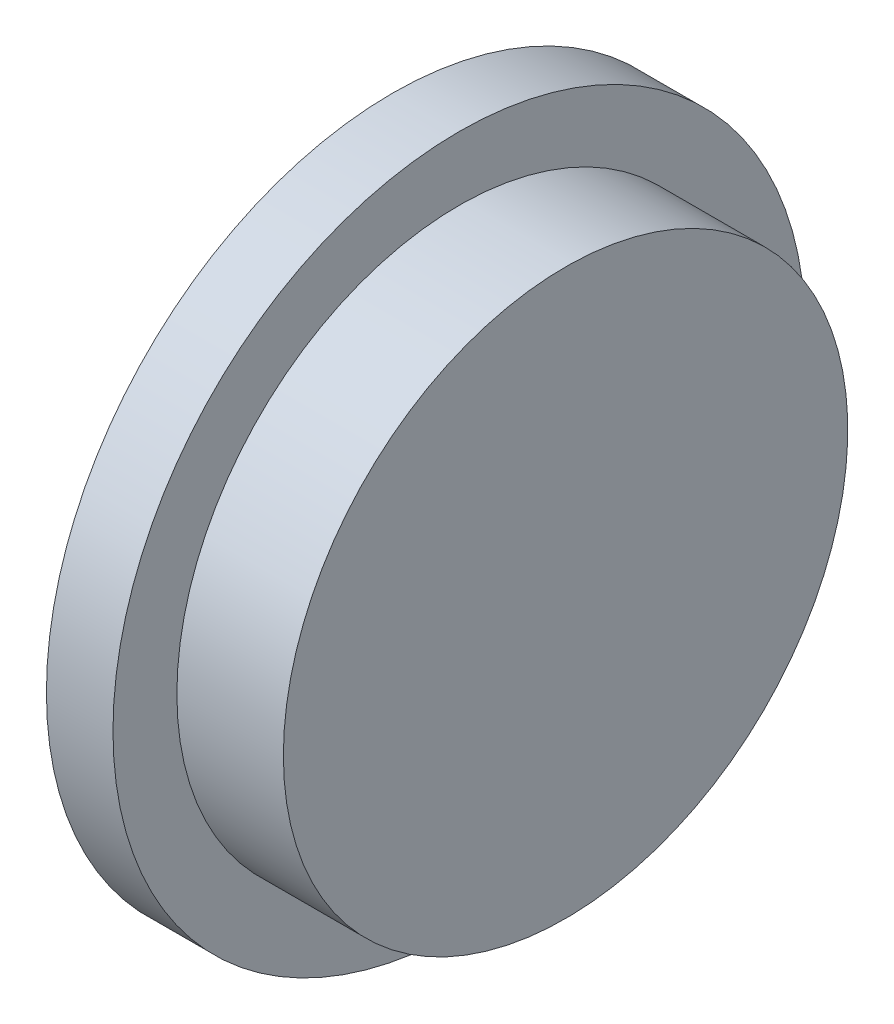
ISO-10303-21;
HEADER;
FILE_DESCRIPTION(('STEP AP214'),'2;1');
FILE_NAME('part.step','',(''),(''),'','','');
FILE_SCHEMA(('AUTOMOTIVE_DESIGN { 1 0 10303 214 1 1 1 1 }'));
ENDSEC;
DATA;
#1=APPLICATION_CONTEXT('core data for automotive mechanical design processes');
#2=APPLICATION_PROTOCOL_DEFINITION('international standard','automotive_design',2000,#1);
#3=PRODUCT_CONTEXT('',#1,'mechanical');
#4=PRODUCT('Part','Part','',(#3));
#5=PRODUCT_RELATED_PRODUCT_CATEGORY('part','',(#4));
#6=PRODUCT_DEFINITION_FORMATION('','',#4);
#7=PRODUCT_DEFINITION_CONTEXT('part definition',#1,'design');
#8=PRODUCT_DEFINITION('design','',#6,#7);
#9=PRODUCT_DEFINITION_SHAPE('','',#8);
#10=(LENGTH_UNIT() NAMED_UNIT(*) SI_UNIT(.MILLI.,.METRE.));
#11=(NAMED_UNIT(*) PLANE_ANGLE_UNIT() SI_UNIT($,.RADIAN.));
#12=(NAMED_UNIT(*) SI_UNIT($,.STERADIAN.) SOLID_ANGLE_UNIT());
#13=UNCERTAINTY_MEASURE_WITH_UNIT(LENGTH_MEASURE(1.E-05),#10,'distance_accuracy_value','');
#14=(GEOMETRIC_REPRESENTATION_CONTEXT(3) GLOBAL_UNCERTAINTY_ASSIGNED_CONTEXT((#13)) GLOBAL_UNIT_ASSIGNED_CONTEXT((#10,
#11,#12)) REPRESENTATION_CONTEXT('',''));
#15=CARTESIAN_POINT('',(0.,0.,0.));
#16=DIRECTION('',(0.,0.,1.));
#17=DIRECTION('',(1.,0.,0.));
#18=AXIS2_PLACEMENT_3D('',#15,#16,#17);
#19=CARTESIAN_POINT('',(0.,0.,0.));
#20=DIRECTION('',(1.,0.,0.));
#21=DIRECTION('',(0.,0.,-1.));
#22=AXIS2_PLACEMENT_3D('',#19,#20,#21);
#23=PLANE('',#22);
#24=CARTESIAN_POINT('',(0.,0.,0.));
#25=DIRECTION('',(-1.,0.,0.));
#26=DIRECTION('',(0.,0.,1.));
#27=AXIS2_PLACEMENT_3D('',#24,#25,#26);
#28=CIRCLE('',#27,2.8);
#29=CARTESIAN_POINT('',(0.,0.,2.8));
#30=VERTEX_POINT('',#29);
#31=EDGE_CURVE('E10',#30,#30,#28,.T.);
#32=ORIENTED_EDGE('',*,*,#31,.T.);
#33=EDGE_LOOP('',(#32));
#34=FACE_BOUND('',#33,.T.);
#35=ADVANCED_FACE('F33',(#34),#23,.F.);
#36=CARTESIAN_POINT('',(-1.67142857142857,0.,0.));
#37=DIRECTION('',(-1.,0.,0.));
#38=DIRECTION('',(0.,0.,1.));
#39=AXIS2_PLACEMENT_3D('',#36,#37,#38);
#40=CYLINDRICAL_SURFACE('',#39,2.8);
#41=ORIENTED_EDGE('',*,*,#31,.F.);
#42=EDGE_LOOP('',(#41));
#43=FACE_BOUND('',#42,.T.);
#44=CARTESIAN_POINT('',(2.,0.,0.));
#45=DIRECTION('',(-1.,0.,0.));
#46=DIRECTION('',(0.,0.,1.));
#47=AXIS2_PLACEMENT_3D('',#44,#45,#46);
#48=CIRCLE('',#47,2.8);
#49=CARTESIAN_POINT('',(2.,0.,2.8));
#50=VERTEX_POINT('',#49);
#51=EDGE_CURVE('E39',#50,#50,#48,.T.);
#52=ORIENTED_EDGE('',*,*,#51,.T.);
#53=EDGE_LOOP('',(#52));
#54=FACE_BOUND('',#53,.T.);
#55=ADVANCED_FACE('F71',(#43,#54),#40,.T.);
#56=CARTESIAN_POINT('',(2.,2.8,0.));
#57=DIRECTION('',(1.,0.,0.));
#58=DIRECTION('',(0.,0.,-1.));
#59=AXIS2_PLACEMENT_3D('',#56,#57,#58);
#60=PLANE('',#59);
#61=ORIENTED_EDGE('',*,*,#51,.F.);
#62=EDGE_LOOP('',(#61));
#63=FACE_BOUND('',#62,.T.);
#64=CARTESIAN_POINT('',(2.,0.,0.));
#65=DIRECTION('',(-1.,0.,0.));
#66=DIRECTION('',(0.,0.,1.));
#67=AXIS2_PLACEMENT_3D('',#64,#65,#66);
#68=CIRCLE('',#67,6.5);
#69=CARTESIAN_POINT('',(2.,0.,6.5));
#70=VERTEX_POINT('',#69);
#71=EDGE_CURVE('E43',#70,#70,#68,.T.);
#72=ORIENTED_EDGE('',*,*,#71,.T.);
#73=EDGE_LOOP('',(#72));
#74=FACE_BOUND('',#73,.T.);
#75=ADVANCED_FACE('F75',(#63,#74),#60,.F.);
#76=CARTESIAN_POINT('',(-1.67142857142857,0.,0.));
#77=DIRECTION('',(-1.,0.,0.));
#78=DIRECTION('',(0.,0.,1.));
#79=AXIS2_PLACEMENT_3D('',#76,#77,#78);
#80=CYLINDRICAL_SURFACE('',#79,6.5);
#81=ORIENTED_EDGE('',*,*,#71,.F.);
#82=EDGE_LOOP('',(#81));
#83=FACE_BOUND('',#82,.T.);
#84=CARTESIAN_POINT('',(3.25,0.,0.));
#85=DIRECTION('',(-1.,0.,0.));
#86=DIRECTION('',(0.,0.,1.));
#87=AXIS2_PLACEMENT_3D('',#84,#85,#86);
#88=CIRCLE('',#87,6.5);
#89=CARTESIAN_POINT('',(3.25,0.,6.5));
#90=VERTEX_POINT('',#89);
#91=EDGE_CURVE('E47',#90,#90,#88,.T.);
#92=ORIENTED_EDGE('',*,*,#91,.T.);
#93=EDGE_LOOP('',(#92));
#94=FACE_BOUND('',#93,.T.);
#95=ADVANCED_FACE('F80',(#83,#94),#80,.T.);
#96=CARTESIAN_POINT('',(3.25,6.5,0.));
#97=DIRECTION('',(-1.,0.,0.));
#98=DIRECTION('',(0.,0.,1.));
#99=AXIS2_PLACEMENT_3D('',#96,#97,#98);
#100=PLANE('',#99);
#101=ORIENTED_EDGE('',*,*,#91,.F.);
#102=EDGE_LOOP('',(#101));
#103=FACE_BOUND('',#102,.T.);
#104=CARTESIAN_POINT('',(3.25,0.,0.));
#105=DIRECTION('',(-1.,0.,0.));
#106=DIRECTION('',(0.,0.,1.));
#107=AXIS2_PLACEMENT_3D('',#104,#105,#106);
#108=CIRCLE('',#107,5.3);
#109=CARTESIAN_POINT('',(3.25,0.,5.3));
#110=VERTEX_POINT('',#109);
#111=EDGE_CURVE('E52',#110,#110,#108,.T.);
#112=ORIENTED_EDGE('',*,*,#111,.T.);
#113=EDGE_LOOP('',(#112));
#114=FACE_BOUND('',#113,.T.);
#115=ADVANCED_FACE('F67',(#103,#114),#100,.F.);
#116=CARTESIAN_POINT('',(-1.67142857142857,0.,0.));
#117=DIRECTION('',(-1.,0.,0.));
#118=DIRECTION('',(0.,0.,1.));
#119=AXIS2_PLACEMENT_3D('',#116,#117,#118);
#120=CYLINDRICAL_SURFACE('',#119,5.3);
#121=ORIENTED_EDGE('',*,*,#111,.F.);
#122=EDGE_LOOP('',(#121));
#123=FACE_BOUND('',#122,.T.);
#124=CARTESIAN_POINT('',(5.25,0.,0.));
#125=DIRECTION('',(-1.,0.,0.));
#126=DIRECTION('',(0.,0.,1.));
#127=AXIS2_PLACEMENT_3D('',#124,#125,#126);
#128=CIRCLE('',#127,5.3);
#129=CARTESIAN_POINT('',(5.25,0.,5.3));
#130=VERTEX_POINT('',#129);
#131=EDGE_CURVE('E55',#130,#130,#128,.T.);
#132=ORIENTED_EDGE('',*,*,#131,.T.);
#133=EDGE_LOOP('',(#132));
#134=FACE_BOUND('',#133,.T.);
#135=ADVANCED_FACE('F59',(#123,#134),#120,.T.);
#136=CARTESIAN_POINT('',(5.25,5.3,0.));
#137=DIRECTION('',(-1.,0.,0.));
#138=DIRECTION('',(0.,0.,1.));
#139=AXIS2_PLACEMENT_3D('',#136,#137,#138);
#140=PLANE('',#139);
#141=ORIENTED_EDGE('',*,*,#131,.F.);
#142=EDGE_LOOP('',(#141));
#143=FACE_BOUND('',#142,.T.);
#144=ADVANCED_FACE('F61',(#143),#140,.F.);
#145=CLOSED_SHELL('',(#35,#55,#75,#95,#115,#135,#144));
#146=MANIFOLD_SOLID_BREP('B2',#145);
#147=ADVANCED_BREP_SHAPE_REPRESENTATION('',(#18,#146),#14);
#148=SHAPE_DEFINITION_REPRESENTATION(#9,#147);
ENDSEC;
END-ISO-10303-21;
